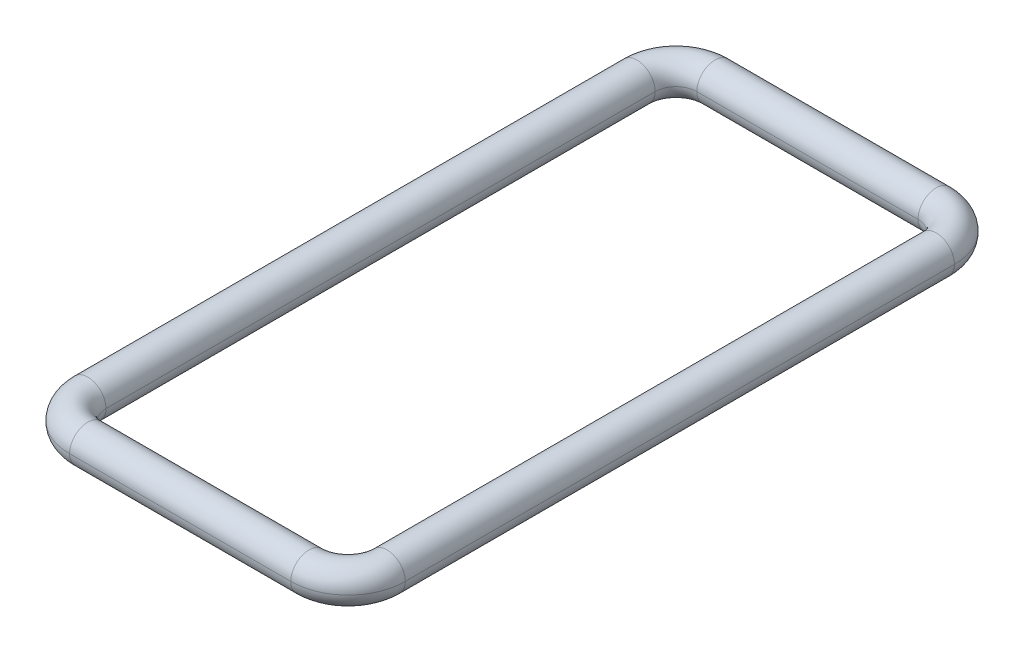
ISO-10303-21;
HEADER;
FILE_DESCRIPTION(('STEP AP214'),'2;1');
FILE_NAME('part.step','',(''),(''),'','','');
FILE_SCHEMA(('AUTOMOTIVE_DESIGN { 1 0 10303 214 1 1 1 1 }'));
ENDSEC;
DATA;
#1=APPLICATION_CONTEXT('core data for automotive mechanical design processes');
#2=APPLICATION_PROTOCOL_DEFINITION('international standard','automotive_design',2000,#1);
#3=PRODUCT_CONTEXT('',#1,'mechanical');
#4=PRODUCT('Part','Part','',(#3));
#5=PRODUCT_RELATED_PRODUCT_CATEGORY('part','',(#4));
#6=PRODUCT_DEFINITION_FORMATION('','',#4);
#7=PRODUCT_DEFINITION_CONTEXT('part definition',#1,'design');
#8=PRODUCT_DEFINITION('design','',#6,#7);
#9=PRODUCT_DEFINITION_SHAPE('','',#8);
#10=(LENGTH_UNIT() NAMED_UNIT(*) SI_UNIT(.MILLI.,.METRE.));
#11=(NAMED_UNIT(*) PLANE_ANGLE_UNIT() SI_UNIT($,.RADIAN.));
#12=(NAMED_UNIT(*) SI_UNIT($,.STERADIAN.) SOLID_ANGLE_UNIT());
#13=UNCERTAINTY_MEASURE_WITH_UNIT(LENGTH_MEASURE(1.E-05),#10,'distance_accuracy_value','');
#14=(GEOMETRIC_REPRESENTATION_CONTEXT(3) GLOBAL_UNCERTAINTY_ASSIGNED_CONTEXT((#13)) GLOBAL_UNIT_ASSIGNED_CONTEXT((#10,
#11,#12)) REPRESENTATION_CONTEXT('',''));
#15=CARTESIAN_POINT('',(0.,0.,0.));
#16=DIRECTION('',(0.,0.,1.));
#17=DIRECTION('',(1.,0.,0.));
#18=AXIS2_PLACEMENT_3D('',#15,#16,#17);
#19=CARTESIAN_POINT('',(-0.425,0.98,1.055));
#20=DIRECTION('',(0.,-1.,0.));
#21=DIRECTION('',(0.,0.,-1.));
#22=AXIS2_PLACEMENT_3D('',#19,#20,#21);
#23=TOROIDAL_SURFACE('',#22,0.15,0.07);
#24=CARTESIAN_POINT('',(-0.424999999999999,0.98,1.205));
#25=DIRECTION('',(1.,0.,0.));
#26=DIRECTION('',(0.,0.,-1.));
#27=AXIS2_PLACEMENT_3D('',#24,#25,#26);
#28=CIRCLE('',#27,0.07);
#29=CARTESIAN_POINT('',(-0.424999999999999,0.98,1.275));
#30=VERTEX_POINT('',#29);
#31=CARTESIAN_POINT('',(-0.424999999999998,0.98,1.135));
#32=VERTEX_POINT('',#31);
#33=EDGE_CURVE('E11',#30,#32,#28,.T.);
#34=ORIENTED_EDGE('',*,*,#33,.F.);
#35=CARTESIAN_POINT('',(-0.425,0.98,1.055));
#36=DIRECTION('',(0.,-1.,0.));
#37=DIRECTION('',(0.,0.,-1.));
#38=AXIS2_PLACEMENT_3D('',#35,#36,#37);
#39=CIRCLE('',#38,0.22);
#40=CARTESIAN_POINT('',(-0.645000000000015,0.98,1.055));
#41=VERTEX_POINT('',#40);
#42=EDGE_CURVE('E24',#30,#41,#39,.T.);
#43=ORIENTED_EDGE('',*,*,#42,.T.);
#44=CARTESIAN_POINT('',(-0.575000000000015,0.98,1.055));
#45=DIRECTION('',(0.,0.,1.));
#46=DIRECTION('',(1.,0.,0.));
#47=AXIS2_PLACEMENT_3D('',#44,#45,#46);
#48=CIRCLE('',#47,0.07);
#49=CARTESIAN_POINT('',(-0.505000000000015,0.98,1.055));
#50=VERTEX_POINT('',#49);
#51=EDGE_CURVE('E170',#41,#50,#48,.T.);
#52=ORIENTED_EDGE('',*,*,#51,.T.);
#53=CARTESIAN_POINT('',(-0.425,0.98,1.055));
#54=DIRECTION('',(0.,-1.,0.));
#55=DIRECTION('',(0.,0.,-1.));
#56=AXIS2_PLACEMENT_3D('',#53,#54,#55);
#57=CIRCLE('',#56,0.08);
#58=EDGE_CURVE('E167',#32,#50,#57,.T.);
#59=ORIENTED_EDGE('',*,*,#58,.F.);
#60=EDGE_LOOP('',(#34,#43,#52,#59));
#61=FACE_BOUND('',#60,.T.);
#62=ADVANCED_FACE('F17',(#61),#23,.T.);
#63=CARTESIAN_POINT('',(0.425,0.98,1.055));
#64=DIRECTION('',(0.,-1.,0.));
#65=DIRECTION('',(0.,0.,-1.));
#66=AXIS2_PLACEMENT_3D('',#63,#64,#65);
#67=TOROIDAL_SURFACE('',#66,0.15,0.07);
#68=CARTESIAN_POINT('',(0.574999999999992,0.98,1.055));
#69=DIRECTION('',(0.,0.,-1.));
#70=DIRECTION('',(-1.,0.,0.));
#71=AXIS2_PLACEMENT_3D('',#68,#69,#70);
#72=CIRCLE('',#71,0.07);
#73=CARTESIAN_POINT('',(0.644999999999992,0.98,1.055));
#74=VERTEX_POINT('',#73);
#75=CARTESIAN_POINT('',(0.504999999999992,0.98,1.055));
#76=VERTEX_POINT('',#75);
#77=EDGE_CURVE('E165',#74,#76,#72,.T.);
#78=ORIENTED_EDGE('',*,*,#77,.F.);
#79=CARTESIAN_POINT('',(0.425,0.98,1.055));
#80=DIRECTION('',(0.,-1.,0.));
#81=DIRECTION('',(0.,0.,-1.));
#82=AXIS2_PLACEMENT_3D('',#79,#80,#81);
#83=CIRCLE('',#82,0.22);
#84=CARTESIAN_POINT('',(0.425,0.98,1.275));
#85=VERTEX_POINT('',#84);
#86=EDGE_CURVE('E163',#74,#85,#83,.T.);
#87=ORIENTED_EDGE('',*,*,#86,.T.);
#88=CARTESIAN_POINT('',(0.425,0.98,1.205));
#89=DIRECTION('',(1.,0.,0.));
#90=DIRECTION('',(0.,0.,-1.));
#91=AXIS2_PLACEMENT_3D('',#88,#89,#90);
#92=CIRCLE('',#91,0.07);
#93=CARTESIAN_POINT('',(0.425000000000001,0.98,1.135));
#94=VERTEX_POINT('',#93);
#95=EDGE_CURVE('E161',#85,#94,#92,.T.);
#96=ORIENTED_EDGE('',*,*,#95,.T.);
#97=CARTESIAN_POINT('',(0.425,0.98,1.055));
#98=DIRECTION('',(0.,-1.,0.));
#99=DIRECTION('',(0.,0.,-1.));
#100=AXIS2_PLACEMENT_3D('',#97,#98,#99);
#101=CIRCLE('',#100,0.08);
#102=EDGE_CURVE('E158',#76,#94,#101,.T.);
#103=ORIENTED_EDGE('',*,*,#102,.F.);
#104=EDGE_LOOP('',(#78,#87,#96,#103));
#105=FACE_BOUND('',#104,.T.);
#106=ADVANCED_FACE('F196',(#105),#67,.T.);
#107=CARTESIAN_POINT('',(0.425,0.98,-1.055));
#108=DIRECTION('',(0.,-1.,0.));
#109=DIRECTION('',(0.,0.,-1.));
#110=AXIS2_PLACEMENT_3D('',#107,#108,#109);
#111=TOROIDAL_SURFACE('',#110,0.15,0.07);
#112=CARTESIAN_POINT('',(0.424999999999999,0.98,-1.205));
#113=DIRECTION('',(-1.,0.,0.));
#114=DIRECTION('',(0.,0.,1.));
#115=AXIS2_PLACEMENT_3D('',#112,#113,#114);
#116=CIRCLE('',#115,0.07);
#117=CARTESIAN_POINT('',(0.424999999999999,0.98,-1.275));
#118=VERTEX_POINT('',#117);
#119=CARTESIAN_POINT('',(0.424999999999998,0.98,-1.135));
#120=VERTEX_POINT('',#119);
#121=EDGE_CURVE('E110',#118,#120,#116,.T.);
#122=ORIENTED_EDGE('',*,*,#121,.F.);
#123=CARTESIAN_POINT('',(0.425,0.98,-1.055));
#124=DIRECTION('',(0.,-1.,0.));
#125=DIRECTION('',(0.,0.,-1.));
#126=AXIS2_PLACEMENT_3D('',#123,#124,#125);
#127=CIRCLE('',#126,0.22);
#128=CARTESIAN_POINT('',(0.645,0.98,-1.055));
#129=VERTEX_POINT('',#128);
#130=EDGE_CURVE('E155',#118,#129,#127,.T.);
#131=ORIENTED_EDGE('',*,*,#130,.T.);
#132=CARTESIAN_POINT('',(0.575,0.98,-1.055));
#133=DIRECTION('',(0.,0.,-1.));
#134=DIRECTION('',(-1.,0.,0.));
#135=AXIS2_PLACEMENT_3D('',#132,#133,#134);
#136=CIRCLE('',#135,0.07);
#137=CARTESIAN_POINT('',(0.505,0.98,-1.055));
#138=VERTEX_POINT('',#137);
#139=EDGE_CURVE('E153',#129,#138,#136,.T.);
#140=ORIENTED_EDGE('',*,*,#139,.T.);
#141=CARTESIAN_POINT('',(0.425,0.98,-1.055));
#142=DIRECTION('',(0.,-1.,0.));
#143=DIRECTION('',(0.,0.,-1.));
#144=AXIS2_PLACEMENT_3D('',#141,#142,#143);
#145=CIRCLE('',#144,0.08);
#146=EDGE_CURVE('E150',#120,#138,#145,.T.);
#147=ORIENTED_EDGE('',*,*,#146,.F.);
#148=EDGE_LOOP('',(#122,#131,#140,#147));
#149=FACE_BOUND('',#148,.T.);
#150=ADVANCED_FACE('F193',(#149),#111,.T.);
#151=CARTESIAN_POINT('',(-0.425,0.98,-1.055));
#152=DIRECTION('',(0.,-1.,0.));
#153=DIRECTION('',(0.,0.,-1.));
#154=AXIS2_PLACEMENT_3D('',#151,#152,#153);
#155=TOROIDAL_SURFACE('',#154,0.15,0.07);
#156=CARTESIAN_POINT('',(-0.575,0.98,-1.055));
#157=DIRECTION('',(0.,0.,1.));
#158=DIRECTION('',(1.,0.,0.));
#159=AXIS2_PLACEMENT_3D('',#156,#157,#158);
#160=CIRCLE('',#159,0.07);
#161=CARTESIAN_POINT('',(-0.645,0.98,-1.055));
#162=VERTEX_POINT('',#161);
#163=CARTESIAN_POINT('',(-0.505,0.98,-1.055));
#164=VERTEX_POINT('',#163);
#165=EDGE_CURVE('E148',#162,#164,#160,.T.);
#166=ORIENTED_EDGE('',*,*,#165,.F.);
#167=CARTESIAN_POINT('',(-0.425,0.98,-1.055));
#168=DIRECTION('',(0.,-1.,0.));
#169=DIRECTION('',(0.,0.,-1.));
#170=AXIS2_PLACEMENT_3D('',#167,#168,#169);
#171=CIRCLE('',#170,0.22);
#172=CARTESIAN_POINT('',(-0.425,0.98,-1.275));
#173=VERTEX_POINT('',#172);
#174=EDGE_CURVE('E84',#162,#173,#171,.T.);
#175=ORIENTED_EDGE('',*,*,#174,.T.);
#176=CARTESIAN_POINT('',(-0.425,0.98,-1.205));
#177=DIRECTION('',(-1.,0.,0.));
#178=DIRECTION('',(0.,0.,1.));
#179=AXIS2_PLACEMENT_3D('',#176,#177,#178);
#180=CIRCLE('',#179,0.07);
#181=CARTESIAN_POINT('',(-0.425000000000001,0.98,-1.135));
#182=VERTEX_POINT('',#181);
#183=EDGE_CURVE('E78',#173,#182,#180,.T.);
#184=ORIENTED_EDGE('',*,*,#183,.T.);
#185=CARTESIAN_POINT('',(-0.425,0.98,-1.055));
#186=DIRECTION('',(0.,-1.,0.));
#187=DIRECTION('',(0.,0.,-1.));
#188=AXIS2_PLACEMENT_3D('',#185,#186,#187);
#189=CIRCLE('',#188,0.08);
#190=EDGE_CURVE('E81',#164,#182,#189,.T.);
#191=ORIENTED_EDGE('',*,*,#190,.F.);
#192=EDGE_LOOP('',(#166,#175,#184,#191));
#193=FACE_BOUND('',#192,.T.);
#194=ADVANCED_FACE('F80',(#193),#155,.T.);
#195=CARTESIAN_POINT('',(-0.575000000000008,0.98,1.055));
#196=DIRECTION('',(0.,0.,-1.));
#197=DIRECTION('',(-1.,0.,0.));
#198=AXIS2_PLACEMENT_3D('',#195,#196,#197);
#199=CYLINDRICAL_SURFACE('',#198,0.07);
#200=CARTESIAN_POINT('',(-0.575000000000015,0.98,1.055));
#201=DIRECTION('',(0.,0.,1.));
#202=DIRECTION('',(1.,0.,0.));
#203=AXIS2_PLACEMENT_3D('',#200,#201,#202);
#204=CIRCLE('',#203,0.07);
#205=EDGE_CURVE('E98',#50,#41,#204,.T.);
#206=ORIENTED_EDGE('',*,*,#205,.F.);
#207=DIRECTION('',(0.,0.,-1.));
#208=VECTOR('',#207,1.);
#209=CARTESIAN_POINT('',(-0.505000000000008,0.98,1.055));
#210=LINE('',#209,#208);
#211=EDGE_CURVE('E143',#50,#164,#210,.T.);
#212=ORIENTED_EDGE('',*,*,#211,.T.);
#213=CARTESIAN_POINT('',(-0.575,0.98,-1.055));
#214=DIRECTION('',(0.,0.,1.));
#215=DIRECTION('',(1.,0.,0.));
#216=AXIS2_PLACEMENT_3D('',#213,#214,#215);
#217=CIRCLE('',#216,0.07);
#218=EDGE_CURVE('E97',#164,#162,#217,.T.);
#219=ORIENTED_EDGE('',*,*,#218,.T.);
#220=DIRECTION('',(0.,0.,-1.));
#221=VECTOR('',#220,1.);
#222=CARTESIAN_POINT('',(-0.645000000000008,0.98,1.055));
#223=LINE('',#222,#221);
#224=EDGE_CURVE('E139',#41,#162,#223,.T.);
#225=ORIENTED_EDGE('',*,*,#224,.F.);
#226=EDGE_LOOP('',(#206,#212,#219,#225));
#227=FACE_BOUND('',#226,.T.);
#228=ADVANCED_FACE('F181',(#227),#199,.T.);
#229=CARTESIAN_POINT('',(0.424999999999999,0.98,1.205));
#230=DIRECTION('',(-1.,0.,0.));
#231=DIRECTION('',(0.,0.,1.));
#232=AXIS2_PLACEMENT_3D('',#229,#230,#231);
#233=CYLINDRICAL_SURFACE('',#232,0.07);
#234=CARTESIAN_POINT('',(0.425,0.98,1.205));
#235=DIRECTION('',(1.,0.,0.));
#236=DIRECTION('',(0.,0.,-1.));
#237=AXIS2_PLACEMENT_3D('',#234,#235,#236);
#238=CIRCLE('',#237,0.07);
#239=EDGE_CURVE('E136',#94,#85,#238,.T.);
#240=ORIENTED_EDGE('',*,*,#239,.F.);
#241=DIRECTION('',(-1.,0.,0.));
#242=VECTOR('',#241,1.);
#243=CARTESIAN_POINT('',(0.424999999999999,0.98,1.135));
#244=LINE('',#243,#242);
#245=EDGE_CURVE('E133',#94,#32,#244,.T.);
#246=ORIENTED_EDGE('',*,*,#245,.T.);
#247=CARTESIAN_POINT('',(-0.424999999999999,0.98,1.205));
#248=DIRECTION('',(1.,0.,0.));
#249=DIRECTION('',(0.,0.,-1.));
#250=AXIS2_PLACEMENT_3D('',#247,#248,#249);
#251=CIRCLE('',#250,0.07);
#252=EDGE_CURVE('E130',#32,#30,#251,.T.);
#253=ORIENTED_EDGE('',*,*,#252,.T.);
#254=DIRECTION('',(-1.,0.,0.));
#255=VECTOR('',#254,1.);
#256=CARTESIAN_POINT('',(0.424999999999999,0.98,1.275));
#257=LINE('',#256,#255);
#258=EDGE_CURVE('E128',#85,#30,#257,.T.);
#259=ORIENTED_EDGE('',*,*,#258,.F.);
#260=EDGE_LOOP('',(#240,#246,#253,#259));
#261=FACE_BOUND('',#260,.T.);
#262=ADVANCED_FACE('F183',(#261),#233,.T.);
#263=CARTESIAN_POINT('',(0.575,0.98,-1.055));
#264=DIRECTION('',(0.,0.,1.));
#265=DIRECTION('',(1.,0.,0.));
#266=AXIS2_PLACEMENT_3D('',#263,#264,#265);
#267=CYLINDRICAL_SURFACE('',#266,0.07);
#268=CARTESIAN_POINT('',(0.575,0.98,-1.055));
#269=DIRECTION('',(0.,0.,-1.));
#270=DIRECTION('',(-1.,0.,0.));
#271=AXIS2_PLACEMENT_3D('',#268,#269,#270);
#272=CIRCLE('',#271,0.07);
#273=EDGE_CURVE('E125',#138,#129,#272,.T.);
#274=ORIENTED_EDGE('',*,*,#273,.F.);
#275=DIRECTION('',(0.,0.,1.));
#276=VECTOR('',#275,1.);
#277=CARTESIAN_POINT('',(0.505,0.98,-1.055));
#278=LINE('',#277,#276);
#279=EDGE_CURVE('E122',#138,#76,#278,.T.);
#280=ORIENTED_EDGE('',*,*,#279,.T.);
#281=CARTESIAN_POINT('',(0.574999999999992,0.98,1.055));
#282=DIRECTION('',(0.,0.,-1.));
#283=DIRECTION('',(-1.,0.,0.));
#284=AXIS2_PLACEMENT_3D('',#281,#282,#283);
#285=CIRCLE('',#284,0.07);
#286=EDGE_CURVE('E119',#76,#74,#285,.T.);
#287=ORIENTED_EDGE('',*,*,#286,.T.);
#288=DIRECTION('',(0.,0.,1.));
#289=VECTOR('',#288,1.);
#290=CARTESIAN_POINT('',(0.645,0.98,-1.055));
#291=LINE('',#290,#289);
#292=EDGE_CURVE('E107',#129,#74,#291,.T.);
#293=ORIENTED_EDGE('',*,*,#292,.F.);
#294=EDGE_LOOP('',(#274,#280,#287,#293));
#295=FACE_BOUND('',#294,.T.);
#296=ADVANCED_FACE('F190',(#295),#267,.T.);
#297=CARTESIAN_POINT('',(-0.424999999999999,0.98,-1.205));
#298=DIRECTION('',(1.,0.,0.));
#299=DIRECTION('',(0.,0.,-1.));
#300=AXIS2_PLACEMENT_3D('',#297,#298,#299);
#301=CYLINDRICAL_SURFACE('',#300,0.07);
#302=CARTESIAN_POINT('',(-0.425,0.98,-1.205));
#303=DIRECTION('',(-1.,0.,0.));
#304=DIRECTION('',(0.,0.,1.));
#305=AXIS2_PLACEMENT_3D('',#302,#303,#304);
#306=CIRCLE('',#305,0.07);
#307=EDGE_CURVE('E94',#182,#173,#306,.T.);
#308=ORIENTED_EDGE('',*,*,#307,.F.);
#309=DIRECTION('',(1.,0.,0.));
#310=VECTOR('',#309,1.);
#311=CARTESIAN_POINT('',(-0.424999999999999,0.98,-1.135));
#312=LINE('',#311,#310);
#313=EDGE_CURVE('E104',#182,#120,#312,.T.);
#314=ORIENTED_EDGE('',*,*,#313,.T.);
#315=CARTESIAN_POINT('',(0.424999999999999,0.98,-1.205));
#316=DIRECTION('',(-1.,0.,0.));
#317=DIRECTION('',(0.,0.,1.));
#318=AXIS2_PLACEMENT_3D('',#315,#316,#317);
#319=CIRCLE('',#318,0.07);
#320=EDGE_CURVE('E112',#120,#118,#319,.T.);
#321=ORIENTED_EDGE('',*,*,#320,.T.);
#322=DIRECTION('',(1.,0.,0.));
#323=VECTOR('',#322,1.);
#324=CARTESIAN_POINT('',(-0.424999999999999,0.98,-1.275));
#325=LINE('',#324,#323);
#326=EDGE_CURVE('E106',#173,#118,#325,.T.);
#327=ORIENTED_EDGE('',*,*,#326,.F.);
#328=EDGE_LOOP('',(#308,#314,#321,#327));
#329=FACE_BOUND('',#328,.T.);
#330=ADVANCED_FACE('F102',(#329),#301,.T.);
#331=CARTESIAN_POINT('',(-0.425,0.98,-1.055));
#332=DIRECTION('',(0.,-1.,0.));
#333=DIRECTION('',(0.,0.,-1.));
#334=AXIS2_PLACEMENT_3D('',#331,#332,#333);
#335=TOROIDAL_SURFACE('',#334,0.15,0.07);
#336=ORIENTED_EDGE('',*,*,#174,.F.);
#337=ORIENTED_EDGE('',*,*,#218,.F.);
#338=ORIENTED_EDGE('',*,*,#190,.T.);
#339=ORIENTED_EDGE('',*,*,#307,.T.);
#340=EDGE_LOOP('',(#336,#337,#338,#339));
#341=FACE_BOUND('',#340,.T.);
#342=ADVANCED_FACE('F93',(#341),#335,.T.);
#343=CARTESIAN_POINT('',(-0.424999999999999,0.98,-1.205));
#344=DIRECTION('',(1.,0.,0.));
#345=DIRECTION('',(0.,0.,-1.));
#346=AXIS2_PLACEMENT_3D('',#343,#344,#345);
#347=CYLINDRICAL_SURFACE('',#346,0.07);
#348=ORIENTED_EDGE('',*,*,#313,.F.);
#349=ORIENTED_EDGE('',*,*,#183,.F.);
#350=ORIENTED_EDGE('',*,*,#326,.T.);
#351=ORIENTED_EDGE('',*,*,#121,.T.);
#352=EDGE_LOOP('',(#348,#349,#350,#351));
#353=FACE_BOUND('',#352,.T.);
#354=ADVANCED_FACE('F109',(#353),#347,.T.);
#355=CARTESIAN_POINT('',(0.425,0.98,-1.055));
#356=DIRECTION('',(0.,-1.,0.));
#357=DIRECTION('',(0.,0.,-1.));
#358=AXIS2_PLACEMENT_3D('',#355,#356,#357);
#359=TOROIDAL_SURFACE('',#358,0.15,0.07);
#360=ORIENTED_EDGE('',*,*,#130,.F.);
#361=ORIENTED_EDGE('',*,*,#320,.F.);
#362=ORIENTED_EDGE('',*,*,#146,.T.);
#363=ORIENTED_EDGE('',*,*,#273,.T.);
#364=EDGE_LOOP('',(#360,#361,#362,#363));
#365=FACE_BOUND('',#364,.T.);
#366=ADVANCED_FACE('F223',(#365),#359,.T.);
#367=CARTESIAN_POINT('',(0.575,0.98,-1.055));
#368=DIRECTION('',(0.,0.,1.));
#369=DIRECTION('',(1.,0.,0.));
#370=AXIS2_PLACEMENT_3D('',#367,#368,#369);
#371=CYLINDRICAL_SURFACE('',#370,0.07);
#372=ORIENTED_EDGE('',*,*,#279,.F.);
#373=ORIENTED_EDGE('',*,*,#139,.F.);
#374=ORIENTED_EDGE('',*,*,#292,.T.);
#375=ORIENTED_EDGE('',*,*,#77,.T.);
#376=EDGE_LOOP('',(#372,#373,#374,#375));
#377=FACE_BOUND('',#376,.T.);
#378=ADVANCED_FACE('F220',(#377),#371,.T.);
#379=CARTESIAN_POINT('',(0.425,0.98,1.055));
#380=DIRECTION('',(0.,-1.,0.));
#381=DIRECTION('',(0.,0.,-1.));
#382=AXIS2_PLACEMENT_3D('',#379,#380,#381);
#383=TOROIDAL_SURFACE('',#382,0.15,0.07);
#384=ORIENTED_EDGE('',*,*,#86,.F.);
#385=ORIENTED_EDGE('',*,*,#286,.F.);
#386=ORIENTED_EDGE('',*,*,#102,.T.);
#387=ORIENTED_EDGE('',*,*,#239,.T.);
#388=EDGE_LOOP('',(#384,#385,#386,#387));
#389=FACE_BOUND('',#388,.T.);
#390=ADVANCED_FACE('F213',(#389),#383,.T.);
#391=CARTESIAN_POINT('',(0.424999999999999,0.98,1.205));
#392=DIRECTION('',(-1.,0.,0.));
#393=DIRECTION('',(0.,0.,1.));
#394=AXIS2_PLACEMENT_3D('',#391,#392,#393);
#395=CYLINDRICAL_SURFACE('',#394,0.07);
#396=ORIENTED_EDGE('',*,*,#245,.F.);
#397=ORIENTED_EDGE('',*,*,#95,.F.);
#398=ORIENTED_EDGE('',*,*,#258,.T.);
#399=ORIENTED_EDGE('',*,*,#33,.T.);
#400=EDGE_LOOP('',(#396,#397,#398,#399));
#401=FACE_BOUND('',#400,.T.);
#402=ADVANCED_FACE('F284',(#401),#395,.T.);
#403=CARTESIAN_POINT('',(-0.425,0.98,1.055));
#404=DIRECTION('',(0.,-1.,0.));
#405=DIRECTION('',(0.,0.,-1.));
#406=AXIS2_PLACEMENT_3D('',#403,#404,#405);
#407=TOROIDAL_SURFACE('',#406,0.15,0.07);
#408=ORIENTED_EDGE('',*,*,#42,.F.);
#409=ORIENTED_EDGE('',*,*,#252,.F.);
#410=ORIENTED_EDGE('',*,*,#58,.T.);
#411=ORIENTED_EDGE('',*,*,#205,.T.);
#412=EDGE_LOOP('',(#408,#409,#410,#411));
#413=FACE_BOUND('',#412,.T.);
#414=ADVANCED_FACE('F179',(#413),#407,.T.);
#415=CARTESIAN_POINT('',(-0.575000000000008,0.98,1.055));
#416=DIRECTION('',(0.,0.,-1.));
#417=DIRECTION('',(-1.,0.,0.));
#418=AXIS2_PLACEMENT_3D('',#415,#416,#417);
#419=CYLINDRICAL_SURFACE('',#418,0.07);
#420=ORIENTED_EDGE('',*,*,#211,.F.);
#421=ORIENTED_EDGE('',*,*,#51,.F.);
#422=ORIENTED_EDGE('',*,*,#224,.T.);
#423=ORIENTED_EDGE('',*,*,#165,.T.);
#424=EDGE_LOOP('',(#420,#421,#422,#423));
#425=FACE_BOUND('',#424,.T.);
#426=ADVANCED_FACE('F176',(#425),#419,.T.);
#427=CLOSED_SHELL('',(#62,#106,#150,#194,#228,#262,#296,#330,#342,#354,#366,#378,#390,#402,#414,#426));
#428=MANIFOLD_SOLID_BREP('B1',#427);
#429=ADVANCED_BREP_SHAPE_REPRESENTATION('',(#18,#428),#14);
#430=SHAPE_DEFINITION_REPRESENTATION(#9,#429);
ENDSEC;
END-ISO-10303-21;
